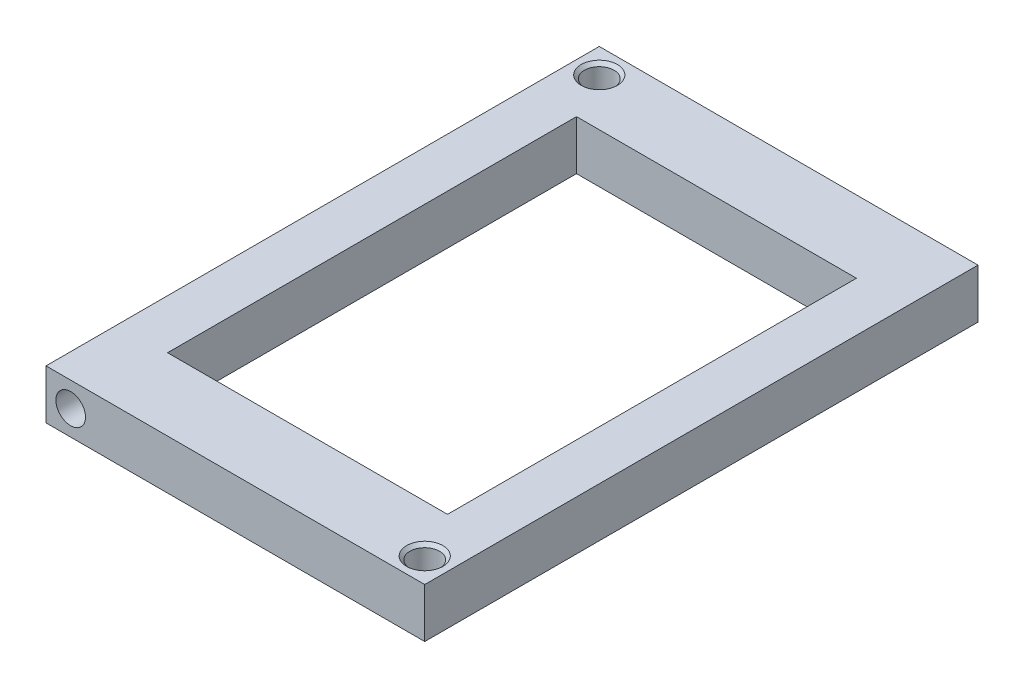
ISO-10303-21;
HEADER;
FILE_DESCRIPTION(('STEP AP214'),'2;1');
FILE_NAME('part.step','',(''),(''),'','','');
FILE_SCHEMA(('AUTOMOTIVE_DESIGN { 1 0 10303 214 1 1 1 1 }'));
ENDSEC;
DATA;
#1=APPLICATION_CONTEXT('core data for automotive mechanical design processes');
#2=APPLICATION_PROTOCOL_DEFINITION('international standard','automotive_design',2000,#1);
#3=PRODUCT_CONTEXT('',#1,'mechanical');
#4=PRODUCT('Part','Part','',(#3));
#5=PRODUCT_RELATED_PRODUCT_CATEGORY('part','',(#4));
#6=PRODUCT_DEFINITION_FORMATION('','',#4);
#7=PRODUCT_DEFINITION_CONTEXT('part definition',#1,'design');
#8=PRODUCT_DEFINITION('design','',#6,#7);
#9=PRODUCT_DEFINITION_SHAPE('','',#8);
#10=(LENGTH_UNIT() NAMED_UNIT(*) SI_UNIT(.MILLI.,.METRE.));
#11=(NAMED_UNIT(*) PLANE_ANGLE_UNIT() SI_UNIT($,.RADIAN.));
#12=(NAMED_UNIT(*) SI_UNIT($,.STERADIAN.) SOLID_ANGLE_UNIT());
#13=UNCERTAINTY_MEASURE_WITH_UNIT(LENGTH_MEASURE(1.E-05),#10,'distance_accuracy_value','');
#14=(GEOMETRIC_REPRESENTATION_CONTEXT(3) GLOBAL_UNCERTAINTY_ASSIGNED_CONTEXT((#13)) GLOBAL_UNIT_ASSIGNED_CONTEXT((#10,
#11,#12)) REPRESENTATION_CONTEXT('',''));
#15=CARTESIAN_POINT('',(0.,0.,0.));
#16=DIRECTION('',(0.,0.,1.));
#17=DIRECTION('',(1.,0.,0.));
#18=AXIS2_PLACEMENT_3D('',#15,#16,#17);
#19=CARTESIAN_POINT('',(34.1577040324396,21.1674061660455,84.));
#20=DIRECTION('',(-1.,0.,0.));
#21=DIRECTION('',(0.,0.,1.));
#22=AXIS2_PLACEMENT_3D('',#19,#20,#21);
#23=PLANE('',#22);
#24=DIRECTION('',(0.,1.,0.));
#25=VECTOR('',#24,1.);
#26=CARTESIAN_POINT('',(34.1577040324396,21.1674061660455,0.));
#27=LINE('',#26,#25);
#28=CARTESIAN_POINT('',(34.1577040324396,13.6674061660455,0.));
#29=VERTEX_POINT('',#28);
#30=CARTESIAN_POINT('',(34.1577040324396,21.1674061660455,0.));
#31=VERTEX_POINT('',#30);
#32=EDGE_CURVE('E142',#29,#31,#27,.T.);
#33=ORIENTED_EDGE('',*,*,#32,.T.);
#34=DIRECTION('',(0.,0.,-1.));
#35=VECTOR('',#34,1.);
#36=CARTESIAN_POINT('',(34.1577040324396,21.1674061660455,84.));
#37=LINE('',#36,#35);
#38=CARTESIAN_POINT('',(34.1577040324396,21.1674061660455,84.));
#39=VERTEX_POINT('',#38);
#40=EDGE_CURVE('E168',#39,#31,#37,.T.);
#41=ORIENTED_EDGE('',*,*,#40,.F.);
#42=DIRECTION('',(0.,1.,0.));
#43=VECTOR('',#42,1.);
#44=CARTESIAN_POINT('',(34.1577040324396,21.1674061660455,84.));
#45=LINE('',#44,#43);
#46=CARTESIAN_POINT('',(34.1577040324396,13.6674061660455,84.));
#47=VERTEX_POINT('',#46);
#48=EDGE_CURVE('E148',#47,#39,#45,.T.);
#49=ORIENTED_EDGE('',*,*,#48,.F.);
#50=DIRECTION('',(0.,0.,-1.));
#51=VECTOR('',#50,1.);
#52=CARTESIAN_POINT('',(34.1577040324396,13.6674061660455,84.));
#53=LINE('',#52,#51);
#54=EDGE_CURVE('E171',#47,#29,#53,.T.);
#55=ORIENTED_EDGE('',*,*,#54,.T.);
#56=EDGE_LOOP('',(#33,#41,#49,#55));
#57=FACE_BOUND('',#56,.T.);
#58=ADVANCED_FACE('F44',(#57),#23,.F.);
#59=CARTESIAN_POINT('',(-23.3422959675604,21.1674061660455,84.));
#60=DIRECTION('',(0.,-1.,0.));
#61=DIRECTION('',(0.,0.,-1.));
#62=AXIS2_PLACEMENT_3D('',#59,#60,#61);
#63=PLANE('',#62);
#64=CARTESIAN_POINT('',(30.4077040324396,21.1674061660455,80.25));
#65=DIRECTION('',(0.,-1.,0.));
#66=DIRECTION('',(0.,0.,-1.));
#67=AXIS2_PLACEMENT_3D('',#64,#65,#66);
#68=CIRCLE('',#67,2.75);
#69=CARTESIAN_POINT('',(30.4077040324396,21.1674061660455,77.5));
#70=VERTEX_POINT('',#69);
#71=EDGE_CURVE('E53',#70,#70,#68,.T.);
#72=ORIENTED_EDGE('',*,*,#71,.T.);
#73=EDGE_LOOP('',(#72));
#74=FACE_BOUND('',#73,.T.);
#75=CARTESIAN_POINT('',(-19.5922959675601,21.1674061660455,3.7499999999998));
#76=DIRECTION('',(0.,-1.,0.));
#77=DIRECTION('',(0.,0.,-1.));
#78=AXIS2_PLACEMENT_3D('',#75,#76,#77);
#79=CIRCLE('',#78,2.75);
#80=CARTESIAN_POINT('',(-19.5922959675601,21.1674061660455,0.999999999999793));
#81=VERTEX_POINT('',#80);
#82=EDGE_CURVE('E177',#81,#81,#79,.T.);
#83=ORIENTED_EDGE('',*,*,#82,.T.);
#84=EDGE_LOOP('',(#83));
#85=FACE_BOUND('',#84,.T.);
#86=DIRECTION('',(1.,0.,0.));
#87=VECTOR('',#86,1.);
#88=CARTESIAN_POINT('',(-15.8422959675604,21.1674061660455,73.0434782608696));
#89=LINE('',#88,#87);
#90=CARTESIAN_POINT('',(-15.8422959675604,21.1674061660455,73.0434782608696));
#91=VERTEX_POINT('',#90);
#92=CARTESIAN_POINT('',(26.6577040324396,21.1674061660455,73.0434782608696));
#93=VERTEX_POINT('',#92);
#94=EDGE_CURVE('E214',#91,#93,#89,.T.);
#95=ORIENTED_EDGE('',*,*,#94,.F.);
#96=DIRECTION('',(0.,0.,1.));
#97=VECTOR('',#96,1.);
#98=CARTESIAN_POINT('',(-15.8422959675604,21.1674061660455,10.9565217391304));
#99=LINE('',#98,#97);
#100=CARTESIAN_POINT('',(-15.8422959675604,21.1674061660455,10.9565217391304));
#101=VERTEX_POINT('',#100);
#102=EDGE_CURVE('E60',#101,#91,#99,.T.);
#103=ORIENTED_EDGE('',*,*,#102,.F.);
#104=DIRECTION('',(-1.,0.,0.));
#105=VECTOR('',#104,1.);
#106=CARTESIAN_POINT('',(-15.8422959675604,21.1674061660455,10.9565217391304));
#107=LINE('',#106,#105);
#108=CARTESIAN_POINT('',(26.6577040324396,21.1674061660455,10.9565217391304));
#109=VERTEX_POINT('',#108);
#110=EDGE_CURVE('E116',#109,#101,#107,.T.);
#111=ORIENTED_EDGE('',*,*,#110,.F.);
#112=DIRECTION('',(0.,0.,-1.));
#113=VECTOR('',#112,1.);
#114=CARTESIAN_POINT('',(26.6577040324396,21.1674061660455,10.9565217391304));
#115=LINE('',#114,#113);
#116=EDGE_CURVE('E211',#93,#109,#115,.T.);
#117=ORIENTED_EDGE('',*,*,#116,.F.);
#118=EDGE_LOOP('',(#95,#103,#111,#117));
#119=FACE_BOUND('',#118,.T.);
#120=DIRECTION('',(-1.,0.,0.));
#121=VECTOR('',#120,1.);
#122=CARTESIAN_POINT('',(-23.3422959675604,21.1674061660455,0.));
#123=LINE('',#122,#121);
#124=CARTESIAN_POINT('',(-23.3422959675604,21.1674061660455,0.));
#125=VERTEX_POINT('',#124);
#126=EDGE_CURVE('E158',#31,#125,#123,.T.);
#127=ORIENTED_EDGE('',*,*,#126,.T.);
#128=DIRECTION('',(0.,0.,-1.));
#129=VECTOR('',#128,1.);
#130=CARTESIAN_POINT('',(-23.3422959675604,21.1674061660455,84.));
#131=LINE('',#130,#129);
#132=CARTESIAN_POINT('',(-23.3422959675604,21.1674061660455,84.));
#133=VERTEX_POINT('',#132);
#134=EDGE_CURVE('E165',#133,#125,#131,.T.);
#135=ORIENTED_EDGE('',*,*,#134,.F.);
#136=DIRECTION('',(-1.,0.,0.));
#137=VECTOR('',#136,1.);
#138=CARTESIAN_POINT('',(-23.3422959675604,21.1674061660455,84.));
#139=LINE('',#138,#137);
#140=EDGE_CURVE('E151',#39,#133,#139,.T.);
#141=ORIENTED_EDGE('',*,*,#140,.F.);
#142=ORIENTED_EDGE('',*,*,#40,.T.);
#143=EDGE_LOOP('',(#127,#135,#141,#142));
#144=FACE_BOUND('',#143,.T.);
#145=ADVANCED_FACE('F182',(#74,#85,#119,#144),#63,.F.);
#146=CARTESIAN_POINT('',(-23.3422959675604,21.1674061660455,84.));
#147=DIRECTION('',(1.,0.,0.));
#148=DIRECTION('',(0.,0.,-1.));
#149=AXIS2_PLACEMENT_3D('',#146,#147,#148);
#150=PLANE('',#149);
#151=DIRECTION('',(0.,-1.,0.));
#152=VECTOR('',#151,1.);
#153=CARTESIAN_POINT('',(-23.3422959675604,21.1674061660455,0.));
#154=LINE('',#153,#152);
#155=CARTESIAN_POINT('',(-23.3422959675604,13.6674061660455,0.));
#156=VERTEX_POINT('',#155);
#157=EDGE_CURVE('E160',#125,#156,#154,.T.);
#158=ORIENTED_EDGE('',*,*,#157,.T.);
#159=DIRECTION('',(0.,0.,-1.));
#160=VECTOR('',#159,1.);
#161=CARTESIAN_POINT('',(-23.3422959675604,13.6674061660455,84.));
#162=LINE('',#161,#160);
#163=CARTESIAN_POINT('',(-23.3422959675604,13.6674061660455,84.));
#164=VERTEX_POINT('',#163);
#165=EDGE_CURVE('E156',#164,#156,#162,.T.);
#166=ORIENTED_EDGE('',*,*,#165,.F.);
#167=DIRECTION('',(0.,-1.,0.));
#168=VECTOR('',#167,1.);
#169=CARTESIAN_POINT('',(-23.3422959675604,21.1674061660455,84.));
#170=LINE('',#169,#168);
#171=EDGE_CURVE('E153',#133,#164,#170,.T.);
#172=ORIENTED_EDGE('',*,*,#171,.F.);
#173=ORIENTED_EDGE('',*,*,#134,.T.);
#174=EDGE_LOOP('',(#158,#166,#172,#173));
#175=FACE_BOUND('',#174,.T.);
#176=ADVANCED_FACE('F237',(#175),#150,.F.);
#177=CARTESIAN_POINT('',(-15.8422959675604,13.6674061660455,84.));
#178=DIRECTION('',(0.,1.,0.));
#179=DIRECTION('',(0.,0.,1.));
#180=AXIS2_PLACEMENT_3D('',#177,#178,#179);
#181=PLANE('',#180);
#182=CARTESIAN_POINT('',(30.4077040324396,13.6674061660455,80.25));
#183=DIRECTION('',(0.,1.,0.));
#184=DIRECTION('',(0.,0.,1.));
#185=AXIS2_PLACEMENT_3D('',#182,#183,#184);
#186=CIRCLE('',#185,2.25);
#187=CARTESIAN_POINT('',(30.4077040324396,13.6674061660455,82.5));
#188=VERTEX_POINT('',#187);
#189=EDGE_CURVE('E131',#188,#188,#186,.F.);
#190=ORIENTED_EDGE('',*,*,#189,.F.);
#191=EDGE_LOOP('',(#190));
#192=FACE_BOUND('',#191,.T.);
#193=DIRECTION('',(1.,0.,0.));
#194=VECTOR('',#193,1.);
#195=CARTESIAN_POINT('',(-15.8422959675604,13.6674061660455,10.9565217391304));
#196=LINE('',#195,#194);
#197=CARTESIAN_POINT('',(-15.8422959675604,13.6674061660455,10.9565217391304));
#198=VERTEX_POINT('',#197);
#199=CARTESIAN_POINT('',(26.6577040324396,13.6674061660455,10.9565217391304));
#200=VERTEX_POINT('',#199);
#201=EDGE_CURVE('E114',#198,#200,#196,.T.);
#202=ORIENTED_EDGE('',*,*,#201,.F.);
#203=DIRECTION('',(0.,0.,-1.));
#204=VECTOR('',#203,1.);
#205=CARTESIAN_POINT('',(-15.8422959675604,13.6674061660455,10.9565217391304));
#206=LINE('',#205,#204);
#207=CARTESIAN_POINT('',(-15.8422959675604,13.6674061660455,73.0434782608696));
#208=VERTEX_POINT('',#207);
#209=EDGE_CURVE('E121',#208,#198,#206,.T.);
#210=ORIENTED_EDGE('',*,*,#209,.F.);
#211=DIRECTION('',(-1.,0.,0.));
#212=VECTOR('',#211,1.);
#213=CARTESIAN_POINT('',(-15.8422959675604,13.6674061660455,73.0434782608696));
#214=LINE('',#213,#212);
#215=CARTESIAN_POINT('',(26.6577040324396,13.6674061660455,73.0434782608696));
#216=VERTEX_POINT('',#215);
#217=EDGE_CURVE('E118',#216,#208,#214,.T.);
#218=ORIENTED_EDGE('',*,*,#217,.F.);
#219=DIRECTION('',(0.,0.,1.));
#220=VECTOR('',#219,1.);
#221=CARTESIAN_POINT('',(26.6577040324396,13.6674061660455,10.9565217391304));
#222=LINE('',#221,#220);
#223=EDGE_CURVE('E68',#200,#216,#222,.T.);
#224=ORIENTED_EDGE('',*,*,#223,.F.);
#225=EDGE_LOOP('',(#202,#210,#218,#224));
#226=FACE_BOUND('',#225,.T.);
#227=CARTESIAN_POINT('',(-19.5922959675601,13.6674061660455,3.7499999999998));
#228=DIRECTION('',(0.,1.,0.));
#229=DIRECTION('',(0.,0.,1.));
#230=AXIS2_PLACEMENT_3D('',#227,#228,#229);
#231=CIRCLE('',#230,2.25);
#232=CARTESIAN_POINT('',(-19.5922959675601,13.6674061660455,5.9999999999998));
#233=VERTEX_POINT('',#232);
#234=EDGE_CURVE('E135',#233,#233,#231,.F.);
#235=ORIENTED_EDGE('',*,*,#234,.F.);
#236=EDGE_LOOP('',(#235));
#237=FACE_BOUND('',#236,.T.);
#238=DIRECTION('',(1.,0.,0.));
#239=VECTOR('',#238,1.);
#240=CARTESIAN_POINT('',(-15.8422959675604,13.6674061660455,0.));
#241=LINE('',#240,#239);
#242=EDGE_CURVE('E149',#156,#29,#241,.T.);
#243=ORIENTED_EDGE('',*,*,#242,.T.);
#244=ORIENTED_EDGE('',*,*,#54,.F.);
#245=DIRECTION('',(1.,0.,0.));
#246=VECTOR('',#245,1.);
#247=CARTESIAN_POINT('',(-15.8422959675604,13.6674061660455,84.));
#248=LINE('',#247,#246);
#249=EDGE_CURVE('E146',#164,#47,#248,.T.);
#250=ORIENTED_EDGE('',*,*,#249,.F.);
#251=ORIENTED_EDGE('',*,*,#165,.T.);
#252=EDGE_LOOP('',(#243,#244,#250,#251));
#253=FACE_BOUND('',#252,.T.);
#254=ADVANCED_FACE('F128',(#192,#226,#237,#253),#181,.F.);
#255=CARTESIAN_POINT('',(0.,0.,84.));
#256=DIRECTION('',(0.,0.,-1.));
#257=DIRECTION('',(-1.,0.,0.));
#258=AXIS2_PLACEMENT_3D('',#255,#256,#257);
#259=PLANE('',#258);
#260=CARTESIAN_POINT('',(-19.5922959675604,17.4174061660455,84.));
#261=DIRECTION('',(0.,0.,1.));
#262=DIRECTION('',(1.,0.,0.));
#263=AXIS2_PLACEMENT_3D('',#260,#261,#262);
#264=CIRCLE('',#263,2.25);
#265=CARTESIAN_POINT('',(-17.3422959675604,17.4174061660455,84.));
#266=VERTEX_POINT('',#265);
#267=EDGE_CURVE('E143',#266,#266,#264,.T.);
#268=ORIENTED_EDGE('',*,*,#267,.F.);
#269=EDGE_LOOP('',(#268));
#270=FACE_BOUND('',#269,.T.);
#271=ORIENTED_EDGE('',*,*,#249,.T.);
#272=ORIENTED_EDGE('',*,*,#48,.T.);
#273=ORIENTED_EDGE('',*,*,#140,.T.);
#274=ORIENTED_EDGE('',*,*,#171,.T.);
#275=EDGE_LOOP('',(#271,#272,#273,#274));
#276=FACE_BOUND('',#275,.T.);
#277=ADVANCED_FACE('F249',(#270,#276),#259,.F.);
#278=CARTESIAN_POINT('',(0.,0.,0.));
#279=DIRECTION('',(0.,0.,-1.));
#280=DIRECTION('',(-1.,0.,0.));
#281=AXIS2_PLACEMENT_3D('',#278,#279,#280);
#282=PLANE('',#281);
#283=CARTESIAN_POINT('',(30.4077040324395,17.4174061660455,0.));
#284=DIRECTION('',(0.,0.,-1.));
#285=DIRECTION('',(-1.,0.,0.));
#286=AXIS2_PLACEMENT_3D('',#283,#284,#285);
#287=CIRCLE('',#286,2.25);
#288=CARTESIAN_POINT('',(28.1577040324395,17.4174061660455,0.));
#289=VERTEX_POINT('',#288);
#290=EDGE_CURVE('E203',#289,#289,#287,.T.);
#291=ORIENTED_EDGE('',*,*,#290,.F.);
#292=EDGE_LOOP('',(#291));
#293=FACE_BOUND('',#292,.T.);
#294=ORIENTED_EDGE('',*,*,#32,.F.);
#295=ORIENTED_EDGE('',*,*,#242,.F.);
#296=ORIENTED_EDGE('',*,*,#157,.F.);
#297=ORIENTED_EDGE('',*,*,#126,.F.);
#298=EDGE_LOOP('',(#294,#295,#296,#297));
#299=FACE_BOUND('',#298,.T.);
#300=ADVANCED_FACE('F250',(#293,#299),#282,.T.);
#301=CARTESIAN_POINT('',(-19.5922959675604,17.4174061660455,59.));
#302=DIRECTION('',(0.,0.,1.));
#303=DIRECTION('',(1.,0.,0.));
#304=AXIS2_PLACEMENT_3D('',#301,#302,#303);
#305=CYLINDRICAL_SURFACE('',#304,2.25);
#306=CARTESIAN_POINT('',(-19.5922959675604,17.4174061660455,59.));
#307=DIRECTION('',(0.,0.,1.));
#308=DIRECTION('',(1.,0.,0.));
#309=AXIS2_PLACEMENT_3D('',#306,#307,#308);
#310=CIRCLE('',#309,2.25);
#311=CARTESIAN_POINT('',(-17.3422959675604,17.4174061660455,59.));
#312=VERTEX_POINT('',#311);
#313=EDGE_CURVE('E139',#312,#312,#310,.T.);
#314=ORIENTED_EDGE('',*,*,#313,.F.);
#315=EDGE_LOOP('',(#314));
#316=FACE_BOUND('',#315,.T.);
#317=ORIENTED_EDGE('',*,*,#267,.T.);
#318=EDGE_LOOP('',(#317));
#319=FACE_BOUND('',#318,.T.);
#320=ADVANCED_FACE('F253',(#316,#319),#305,.F.);
#321=CARTESIAN_POINT('',(-19.5922959675604,17.4174061660455,59.));
#322=DIRECTION('',(0.,0.,1.));
#323=DIRECTION('',(1.,0.,0.));
#324=AXIS2_PLACEMENT_3D('',#321,#322,#323);
#325=PLANE('',#324);
#326=ORIENTED_EDGE('',*,*,#313,.T.);
#327=EDGE_LOOP('',(#326));
#328=FACE_BOUND('',#327,.T.);
#329=ADVANCED_FACE('F260',(#328),#325,.T.);
#330=CARTESIAN_POINT('',(-19.5922959675601,13.6664061660455,3.7499999999998));
#331=DIRECTION('',(0.,1.,0.));
#332=DIRECTION('',(0.,0.,1.));
#333=AXIS2_PLACEMENT_3D('',#330,#331,#332);
#334=CYLINDRICAL_SURFACE('',#333,2.25);
#335=CARTESIAN_POINT('',(-19.5922959675601,20.6674061660455,3.7499999999998));
#336=DIRECTION('',(0.,-1.,0.));
#337=DIRECTION('',(0.,0.,-1.));
#338=AXIS2_PLACEMENT_3D('',#335,#336,#337);
#339=CIRCLE('',#338,2.25);
#340=CARTESIAN_POINT('',(-19.5922959675601,20.6674061660455,1.49999999999979));
#341=VERTEX_POINT('',#340);
#342=EDGE_CURVE('E11',#341,#341,#339,.F.);
#343=ORIENTED_EDGE('',*,*,#342,.T.);
#344=EDGE_LOOP('',(#343));
#345=FACE_BOUND('',#344,.T.);
#346=ORIENTED_EDGE('',*,*,#234,.T.);
#347=EDGE_LOOP('',(#346));
#348=FACE_BOUND('',#347,.T.);
#349=ADVANCED_FACE('F264',(#345,#348),#334,.F.);
#350=CARTESIAN_POINT('',(-15.8422959675604,13.6664061660455,10.9565217391304));
#351=DIRECTION('',(-1.,0.,0.));
#352=DIRECTION('',(0.,0.,1.));
#353=AXIS2_PLACEMENT_3D('',#350,#351,#352);
#354=PLANE('',#353);
#355=ORIENTED_EDGE('',*,*,#209,.T.);
#356=DIRECTION('',(0.,1.,0.));
#357=VECTOR('',#356,1.);
#358=CARTESIAN_POINT('',(-15.8422959675604,13.6664061660455,10.9565217391304));
#359=LINE('',#358,#357);
#360=EDGE_CURVE('E110',#198,#101,#359,.T.);
#361=ORIENTED_EDGE('',*,*,#360,.T.);
#362=ORIENTED_EDGE('',*,*,#102,.T.);
#363=DIRECTION('',(0.,1.,0.));
#364=VECTOR('',#363,1.);
#365=CARTESIAN_POINT('',(-15.8422959675604,13.6664061660455,73.0434782608696));
#366=LINE('',#365,#364);
#367=EDGE_CURVE('E123',#208,#91,#366,.T.);
#368=ORIENTED_EDGE('',*,*,#367,.F.);
#369=EDGE_LOOP('',(#355,#361,#362,#368));
#370=FACE_BOUND('',#369,.T.);
#371=ADVANCED_FACE('F122',(#370),#354,.F.);
#372=CARTESIAN_POINT('',(-15.8422959675604,13.6664061660455,10.9565217391304));
#373=DIRECTION('',(0.,0.,-1.));
#374=DIRECTION('',(-1.,0.,0.));
#375=AXIS2_PLACEMENT_3D('',#372,#373,#374);
#376=PLANE('',#375);
#377=ORIENTED_EDGE('',*,*,#201,.T.);
#378=DIRECTION('',(0.,1.,0.));
#379=VECTOR('',#378,1.);
#380=CARTESIAN_POINT('',(26.6577040324396,13.6664061660455,10.9565217391304));
#381=LINE('',#380,#379);
#382=EDGE_CURVE('E117',#200,#109,#381,.T.);
#383=ORIENTED_EDGE('',*,*,#382,.T.);
#384=ORIENTED_EDGE('',*,*,#110,.T.);
#385=ORIENTED_EDGE('',*,*,#360,.F.);
#386=EDGE_LOOP('',(#377,#383,#384,#385));
#387=FACE_BOUND('',#386,.T.);
#388=ADVANCED_FACE('F112',(#387),#376,.F.);
#389=CARTESIAN_POINT('',(26.6577040324396,13.6664061660455,10.9565217391304));
#390=DIRECTION('',(1.,0.,0.));
#391=DIRECTION('',(0.,0.,-1.));
#392=AXIS2_PLACEMENT_3D('',#389,#390,#391);
#393=PLANE('',#392);
#394=ORIENTED_EDGE('',*,*,#223,.T.);
#395=DIRECTION('',(0.,1.,0.));
#396=VECTOR('',#395,1.);
#397=CARTESIAN_POINT('',(26.6577040324396,13.6664061660455,73.0434782608696));
#398=LINE('',#397,#396);
#399=EDGE_CURVE('E207',#216,#93,#398,.T.);
#400=ORIENTED_EDGE('',*,*,#399,.T.);
#401=ORIENTED_EDGE('',*,*,#116,.T.);
#402=ORIENTED_EDGE('',*,*,#382,.F.);
#403=EDGE_LOOP('',(#394,#400,#401,#402));
#404=FACE_BOUND('',#403,.T.);
#405=ADVANCED_FACE('F221',(#404),#393,.F.);
#406=CARTESIAN_POINT('',(-15.8422959675604,13.6664061660455,73.0434782608696));
#407=DIRECTION('',(0.,0.,1.));
#408=DIRECTION('',(1.,0.,0.));
#409=AXIS2_PLACEMENT_3D('',#406,#407,#408);
#410=PLANE('',#409);
#411=ORIENTED_EDGE('',*,*,#217,.T.);
#412=ORIENTED_EDGE('',*,*,#367,.T.);
#413=ORIENTED_EDGE('',*,*,#94,.T.);
#414=ORIENTED_EDGE('',*,*,#399,.F.);
#415=EDGE_LOOP('',(#411,#412,#413,#414));
#416=FACE_BOUND('',#415,.T.);
#417=ADVANCED_FACE('F195',(#416),#410,.F.);
#418=CARTESIAN_POINT('',(30.4077040324396,13.6664061660455,80.25));
#419=DIRECTION('',(0.,1.,0.));
#420=DIRECTION('',(0.,0.,1.));
#421=AXIS2_PLACEMENT_3D('',#418,#419,#420);
#422=CYLINDRICAL_SURFACE('',#421,2.25);
#423=CARTESIAN_POINT('',(30.4077040324396,20.6674061660455,80.25));
#424=DIRECTION('',(0.,-1.,0.));
#425=DIRECTION('',(0.,0.,-1.));
#426=AXIS2_PLACEMENT_3D('',#423,#424,#425);
#427=CIRCLE('',#426,2.25);
#428=CARTESIAN_POINT('',(30.4077040324396,20.6674061660455,78.));
#429=VERTEX_POINT('',#428);
#430=EDGE_CURVE('E174',#429,#429,#427,.F.);
#431=ORIENTED_EDGE('',*,*,#430,.T.);
#432=EDGE_LOOP('',(#431));
#433=FACE_BOUND('',#432,.T.);
#434=ORIENTED_EDGE('',*,*,#189,.T.);
#435=EDGE_LOOP('',(#434));
#436=FACE_BOUND('',#435,.T.);
#437=ADVANCED_FACE('F191',(#433,#436),#422,.F.);
#438=CARTESIAN_POINT('',(30.4077040324395,17.4174061660455,25.));
#439=DIRECTION('',(0.,0.,-1.));
#440=DIRECTION('',(-1.,0.,0.));
#441=AXIS2_PLACEMENT_3D('',#438,#439,#440);
#442=CYLINDRICAL_SURFACE('',#441,2.25);
#443=CARTESIAN_POINT('',(30.4077040324395,17.4174061660455,25.));
#444=DIRECTION('',(0.,0.,-1.));
#445=DIRECTION('',(-1.,0.,0.));
#446=AXIS2_PLACEMENT_3D('',#443,#444,#445);
#447=CIRCLE('',#446,2.25);
#448=CARTESIAN_POINT('',(28.1577040324395,17.4174061660455,25.));
#449=VERTEX_POINT('',#448);
#450=EDGE_CURVE('E138',#449,#449,#447,.T.);
#451=ORIENTED_EDGE('',*,*,#450,.F.);
#452=EDGE_LOOP('',(#451));
#453=FACE_BOUND('',#452,.T.);
#454=ORIENTED_EDGE('',*,*,#290,.T.);
#455=EDGE_LOOP('',(#454));
#456=FACE_BOUND('',#455,.T.);
#457=ADVANCED_FACE('F194',(#453,#456),#442,.F.);
#458=CARTESIAN_POINT('',(30.4077040324395,17.4174061660455,25.));
#459=DIRECTION('',(0.,0.,-1.));
#460=DIRECTION('',(-1.,0.,0.));
#461=AXIS2_PLACEMENT_3D('',#458,#459,#460);
#462=PLANE('',#461);
#463=ORIENTED_EDGE('',*,*,#450,.T.);
#464=EDGE_LOOP('',(#463));
#465=FACE_BOUND('',#464,.T.);
#466=ADVANCED_FACE('F188',(#465),#462,.T.);
#467=CARTESIAN_POINT('',(30.4077040324396,20.6674061660455,80.25));
#468=DIRECTION('',(0.,1.,0.));
#469=DIRECTION('',(0.,0.,1.));
#470=AXIS2_PLACEMENT_3D('',#467,#468,#469);
#471=CONICAL_SURFACE('',#470,2.25,0.785398163397454);
#472=ORIENTED_EDGE('',*,*,#71,.F.);
#473=EDGE_LOOP('',(#472));
#474=FACE_BOUND('',#473,.T.);
#475=ORIENTED_EDGE('',*,*,#430,.F.);
#476=EDGE_LOOP('',(#475));
#477=FACE_BOUND('',#476,.T.);
#478=ADVANCED_FACE('F185',(#474,#477),#471,.F.);
#479=CARTESIAN_POINT('',(-19.5922959675601,20.6674061660455,3.7499999999998));
#480=DIRECTION('',(0.,1.,0.));
#481=DIRECTION('',(0.,0.,1.));
#482=AXIS2_PLACEMENT_3D('',#479,#480,#481);
#483=CONICAL_SURFACE('',#482,2.25,0.785398163397452);
#484=ORIENTED_EDGE('',*,*,#82,.F.);
#485=EDGE_LOOP('',(#484));
#486=FACE_BOUND('',#485,.T.);
#487=ORIENTED_EDGE('',*,*,#342,.F.);
#488=EDGE_LOOP('',(#487));
#489=FACE_BOUND('',#488,.T.);
#490=ADVANCED_FACE('F47',(#486,#489),#483,.F.);
#491=CLOSED_SHELL('',(#58,#145,#176,#254,#277,#300,#320,#329,#349,#371,#388,#405,#417,#437,#457,
#466,#478,#490));
#492=MANIFOLD_SOLID_BREP('B2',#491);
#493=ADVANCED_BREP_SHAPE_REPRESENTATION('',(#18,#492),#14);
#494=SHAPE_DEFINITION_REPRESENTATION(#9,#493);
ENDSEC;
END-ISO-10303-21;
